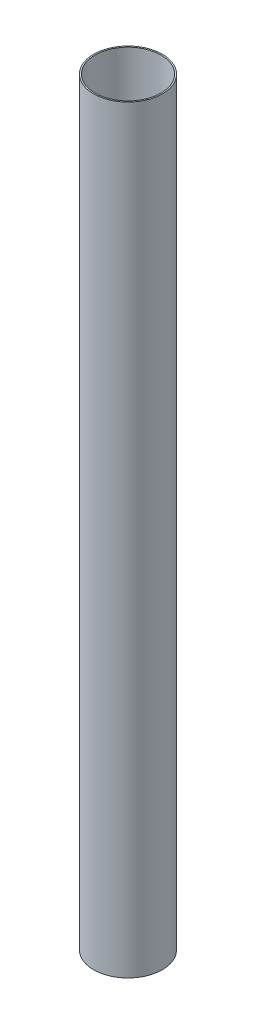
ISO-10303-21;
HEADER;
FILE_DESCRIPTION(('STEP AP214'),'2;1');
FILE_NAME('part.step','',(''),(''),'','','');
FILE_SCHEMA(('AUTOMOTIVE_DESIGN { 1 0 10303 214 1 1 1 1 }'));
ENDSEC;
DATA;
#1=APPLICATION_CONTEXT('core data for automotive mechanical design processes');
#2=APPLICATION_PROTOCOL_DEFINITION('international standard','automotive_design',2000,#1);
#3=PRODUCT_CONTEXT('',#1,'mechanical');
#4=PRODUCT('Part','Part','',(#3));
#5=PRODUCT_RELATED_PRODUCT_CATEGORY('part','',(#4));
#6=PRODUCT_DEFINITION_FORMATION('','',#4);
#7=PRODUCT_DEFINITION_CONTEXT('part definition',#1,'design');
#8=PRODUCT_DEFINITION('design','',#6,#7);
#9=PRODUCT_DEFINITION_SHAPE('','',#8);
#10=(LENGTH_UNIT() NAMED_UNIT(*) SI_UNIT(.MILLI.,.METRE.));
#11=(NAMED_UNIT(*) PLANE_ANGLE_UNIT() SI_UNIT($,.RADIAN.));
#12=(NAMED_UNIT(*) SI_UNIT($,.STERADIAN.) SOLID_ANGLE_UNIT());
#13=UNCERTAINTY_MEASURE_WITH_UNIT(LENGTH_MEASURE(1.E-05),#10,'distance_accuracy_value','');
#14=(GEOMETRIC_REPRESENTATION_CONTEXT(3) GLOBAL_UNCERTAINTY_ASSIGNED_CONTEXT((#13)) GLOBAL_UNIT_ASSIGNED_CONTEXT((#10,
#11,#12)) REPRESENTATION_CONTEXT('',''));
#15=CARTESIAN_POINT('',(0.,0.,0.));
#16=DIRECTION('',(0.,0.,1.));
#17=DIRECTION('',(1.,0.,0.));
#18=AXIS2_PLACEMENT_3D('',#15,#16,#17);
#19=CARTESIAN_POINT('',(0.,1752.6,0.));
#20=DIRECTION('',(0.,1.,0.));
#21=DIRECTION('',(0.,0.,1.));
#22=AXIS2_PLACEMENT_3D('',#19,#20,#21);
#23=PLANE('',#22);
#24=CARTESIAN_POINT('',(0.,1752.6,0.));
#25=DIRECTION('',(0.,1.,0.));
#26=DIRECTION('',(0.,0.,1.));
#27=AXIS2_PLACEMENT_3D('',#24,#25,#26);
#28=CIRCLE('',#27,79.375);
#29=CARTESIAN_POINT('',(0.,1752.6,79.375));
#30=VERTEX_POINT('',#29);
#31=EDGE_CURVE('E10',#30,#30,#28,.T.);
#32=ORIENTED_EDGE('',*,*,#31,.T.);
#33=EDGE_LOOP('',(#32));
#34=FACE_BOUND('',#33,.T.);
#35=CARTESIAN_POINT('',(0.,1752.6,0.));
#36=DIRECTION('',(0.,1.,0.));
#37=DIRECTION('',(0.,0.,1.));
#38=AXIS2_PLACEMENT_3D('',#35,#36,#37);
#39=CIRCLE('',#38,76.2);
#40=CARTESIAN_POINT('',(0.,1752.6,76.2));
#41=VERTEX_POINT('',#40);
#42=EDGE_CURVE('E49',#41,#41,#39,.T.);
#43=ORIENTED_EDGE('',*,*,#42,.F.);
#44=EDGE_LOOP('',(#43));
#45=FACE_BOUND('',#44,.T.);
#46=ADVANCED_FACE('F38',(#34,#45),#23,.T.);
#47=CARTESIAN_POINT('',(0.,0.,0.));
#48=DIRECTION('',(0.,1.,0.));
#49=DIRECTION('',(0.,0.,1.));
#50=AXIS2_PLACEMENT_3D('',#47,#48,#49);
#51=PLANE('',#50);
#52=CARTESIAN_POINT('',(0.,0.,0.));
#53=DIRECTION('',(0.,1.,0.));
#54=DIRECTION('',(0.,0.,1.));
#55=AXIS2_PLACEMENT_3D('',#52,#53,#54);
#56=CIRCLE('',#55,79.375);
#57=CARTESIAN_POINT('',(0.,0.,79.375));
#58=VERTEX_POINT('',#57);
#59=EDGE_CURVE('E42',#58,#58,#56,.T.);
#60=ORIENTED_EDGE('',*,*,#59,.F.);
#61=EDGE_LOOP('',(#60));
#62=FACE_BOUND('',#61,.T.);
#63=CARTESIAN_POINT('',(0.,0.,0.));
#64=DIRECTION('',(0.,1.,0.));
#65=DIRECTION('',(0.,0.,1.));
#66=AXIS2_PLACEMENT_3D('',#63,#64,#65);
#67=CIRCLE('',#66,76.2);
#68=CARTESIAN_POINT('',(0.,0.,76.2));
#69=VERTEX_POINT('',#68);
#70=EDGE_CURVE('E51',#69,#69,#67,.T.);
#71=ORIENTED_EDGE('',*,*,#70,.T.);
#72=EDGE_LOOP('',(#71));
#73=FACE_BOUND('',#72,.T.);
#74=ADVANCED_FACE('F61',(#62,#73),#51,.F.);
#75=CARTESIAN_POINT('',(0.,1752.6,0.));
#76=DIRECTION('',(0.,-1.,0.));
#77=DIRECTION('',(0.,0.,-1.));
#78=AXIS2_PLACEMENT_3D('',#75,#76,#77);
#79=CYLINDRICAL_SURFACE('',#78,79.375);
#80=ORIENTED_EDGE('',*,*,#31,.F.);
#81=EDGE_LOOP('',(#80));
#82=FACE_BOUND('',#81,.T.);
#83=ORIENTED_EDGE('',*,*,#59,.T.);
#84=EDGE_LOOP('',(#83));
#85=FACE_BOUND('',#84,.T.);
#86=ADVANCED_FACE('F40',(#82,#85),#79,.T.);
#87=CARTESIAN_POINT('',(0.,1752.6,0.));
#88=DIRECTION('',(0.,-1.,0.));
#89=DIRECTION('',(0.,0.,-1.));
#90=AXIS2_PLACEMENT_3D('',#87,#88,#89);
#91=CYLINDRICAL_SURFACE('',#90,76.2);
#92=ORIENTED_EDGE('',*,*,#42,.T.);
#93=EDGE_LOOP('',(#92));
#94=FACE_BOUND('',#93,.T.);
#95=ORIENTED_EDGE('',*,*,#70,.F.);
#96=EDGE_LOOP('',(#95));
#97=FACE_BOUND('',#96,.T.);
#98=ADVANCED_FACE('F57',(#94,#97),#91,.F.);
#99=CLOSED_SHELL('',(#46,#74,#86,#98));
#100=MANIFOLD_SOLID_BREP('B2',#99);
#101=ADVANCED_BREP_SHAPE_REPRESENTATION('',(#18,#100),#14);
#102=SHAPE_DEFINITION_REPRESENTATION(#9,#101);
ENDSEC;
END-ISO-10303-21;
